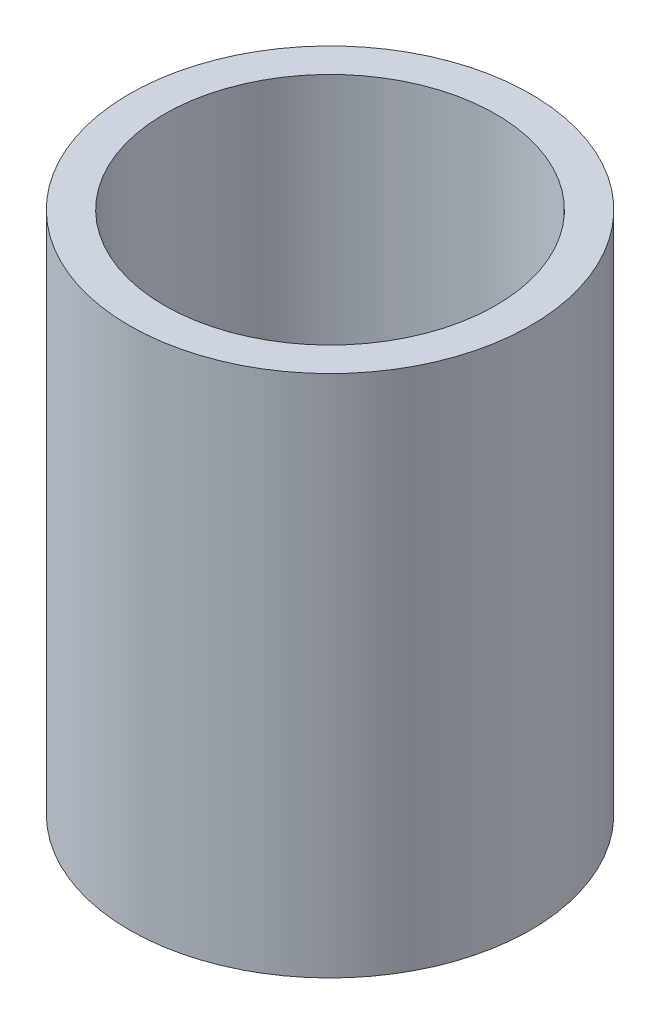
ISO-10303-21;
HEADER;
FILE_DESCRIPTION(('STEP AP214'),'2;1');
FILE_NAME('part.step','',(''),(''),'','','');
FILE_SCHEMA(('AUTOMOTIVE_DESIGN { 1 0 10303 214 1 1 1 1 }'));
ENDSEC;
DATA;
#1=APPLICATION_CONTEXT('core data for automotive mechanical design processes');
#2=APPLICATION_PROTOCOL_DEFINITION('international standard','automotive_design',2000,#1);
#3=PRODUCT_CONTEXT('',#1,'mechanical');
#4=PRODUCT('Part','Part','',(#3));
#5=PRODUCT_RELATED_PRODUCT_CATEGORY('part','',(#4));
#6=PRODUCT_DEFINITION_FORMATION('','',#4);
#7=PRODUCT_DEFINITION_CONTEXT('part definition',#1,'design');
#8=PRODUCT_DEFINITION('design','',#6,#7);
#9=PRODUCT_DEFINITION_SHAPE('','',#8);
#10=(LENGTH_UNIT() NAMED_UNIT(*) SI_UNIT(.MILLI.,.METRE.));
#11=(NAMED_UNIT(*) PLANE_ANGLE_UNIT() SI_UNIT($,.RADIAN.));
#12=(NAMED_UNIT(*) SI_UNIT($,.STERADIAN.) SOLID_ANGLE_UNIT());
#13=UNCERTAINTY_MEASURE_WITH_UNIT(LENGTH_MEASURE(1.E-05),#10,'distance_accuracy_value','');
#14=(GEOMETRIC_REPRESENTATION_CONTEXT(3) GLOBAL_UNCERTAINTY_ASSIGNED_CONTEXT((#13)) GLOBAL_UNIT_ASSIGNED_CONTEXT((#10,
#11,#12)) REPRESENTATION_CONTEXT('',''));
#15=CARTESIAN_POINT('',(0.,0.,0.));
#16=DIRECTION('',(0.,0.,1.));
#17=DIRECTION('',(1.,0.,0.));
#18=AXIS2_PLACEMENT_3D('',#15,#16,#17);
#19=CARTESIAN_POINT('',(-0.929485334809115,6.,-1.20670025922587));
#20=DIRECTION('',(0.,1.,0.));
#21=DIRECTION('',(0.,0.,1.));
#22=AXIS2_PLACEMENT_3D('',#19,#20,#21);
#23=PLANE('',#22);
#24=CARTESIAN_POINT('',(-0.929485334809115,6.,-1.20670025922587));
#25=DIRECTION('',(0.,1.,0.));
#26=DIRECTION('',(0.,0.,1.));
#27=AXIS2_PLACEMENT_3D('',#24,#25,#26);
#28=CIRCLE('',#27,2.3);
#29=CARTESIAN_POINT('',(-0.929485334809115,6.,1.09329974077413));
#30=VERTEX_POINT('',#29);
#31=EDGE_CURVE('E10',#30,#30,#28,.T.);
#32=ORIENTED_EDGE('',*,*,#31,.T.);
#33=EDGE_LOOP('',(#32));
#34=FACE_BOUND('',#33,.T.);
#35=CARTESIAN_POINT('',(-0.929485334809115,6.,-1.20670025922587));
#36=DIRECTION('',(0.,1.,0.));
#37=DIRECTION('',(0.,0.,1.));
#38=AXIS2_PLACEMENT_3D('',#35,#36,#37);
#39=CIRCLE('',#38,1.9);
#40=CARTESIAN_POINT('',(-0.929485334809115,6.,0.693299740774126));
#41=VERTEX_POINT('',#40);
#42=EDGE_CURVE('E50',#41,#41,#39,.T.);
#43=ORIENTED_EDGE('',*,*,#42,.F.);
#44=EDGE_LOOP('',(#43));
#45=FACE_BOUND('',#44,.T.);
#46=ADVANCED_FACE('F37',(#34,#45),#23,.T.);
#47=CARTESIAN_POINT('',(-0.929485334809115,0.,-1.20670025922587));
#48=DIRECTION('',(0.,1.,0.));
#49=DIRECTION('',(0.,0.,1.));
#50=AXIS2_PLACEMENT_3D('',#47,#48,#49);
#51=PLANE('',#50);
#52=CARTESIAN_POINT('',(-0.929485334809115,0.,-1.20670025922587));
#53=DIRECTION('',(0.,1.,0.));
#54=DIRECTION('',(0.,0.,1.));
#55=AXIS2_PLACEMENT_3D('',#52,#53,#54);
#56=CIRCLE('',#55,2.3);
#57=CARTESIAN_POINT('',(-0.929485334809115,0.,1.09329974077413));
#58=VERTEX_POINT('',#57);
#59=EDGE_CURVE('E41',#58,#58,#56,.T.);
#60=ORIENTED_EDGE('',*,*,#59,.F.);
#61=EDGE_LOOP('',(#60));
#62=FACE_BOUND('',#61,.T.);
#63=CARTESIAN_POINT('',(-0.929485334809115,0.,-1.20670025922587));
#64=DIRECTION('',(0.,1.,0.));
#65=DIRECTION('',(0.,0.,1.));
#66=AXIS2_PLACEMENT_3D('',#63,#64,#65);
#67=CIRCLE('',#66,1.9);
#68=CARTESIAN_POINT('',(-0.929485334809115,0.,0.693299740774126));
#69=VERTEX_POINT('',#68);
#70=EDGE_CURVE('E52',#69,#69,#67,.T.);
#71=ORIENTED_EDGE('',*,*,#70,.T.);
#72=EDGE_LOOP('',(#71));
#73=FACE_BOUND('',#72,.T.);
#74=ADVANCED_FACE('F64',(#62,#73),#51,.F.);
#75=CARTESIAN_POINT('',(-0.929485334809115,6.,-1.20670025922587));
#76=DIRECTION('',(0.,-1.,0.));
#77=DIRECTION('',(0.,0.,-1.));
#78=AXIS2_PLACEMENT_3D('',#75,#76,#77);
#79=CYLINDRICAL_SURFACE('',#78,2.3);
#80=ORIENTED_EDGE('',*,*,#31,.F.);
#81=EDGE_LOOP('',(#80));
#82=FACE_BOUND('',#81,.T.);
#83=ORIENTED_EDGE('',*,*,#59,.T.);
#84=EDGE_LOOP('',(#83));
#85=FACE_BOUND('',#84,.T.);
#86=ADVANCED_FACE('F39',(#82,#85),#79,.T.);
#87=CARTESIAN_POINT('',(-0.929485334809115,6.,-1.20670025922587));
#88=DIRECTION('',(0.,-1.,0.));
#89=DIRECTION('',(0.,0.,-1.));
#90=AXIS2_PLACEMENT_3D('',#87,#88,#89);
#91=CYLINDRICAL_SURFACE('',#90,1.9);
#92=ORIENTED_EDGE('',*,*,#42,.T.);
#93=EDGE_LOOP('',(#92));
#94=FACE_BOUND('',#93,.T.);
#95=ORIENTED_EDGE('',*,*,#70,.F.);
#96=EDGE_LOOP('',(#95));
#97=FACE_BOUND('',#96,.T.);
#98=ADVANCED_FACE('F60',(#94,#97),#91,.F.);
#99=CLOSED_SHELL('',(#46,#74,#86,#98));
#100=MANIFOLD_SOLID_BREP('B2',#99);
#101=ADVANCED_BREP_SHAPE_REPRESENTATION('',(#18,#100),#14);
#102=SHAPE_DEFINITION_REPRESENTATION(#9,#101);
ENDSEC;
END-ISO-10303-21;
